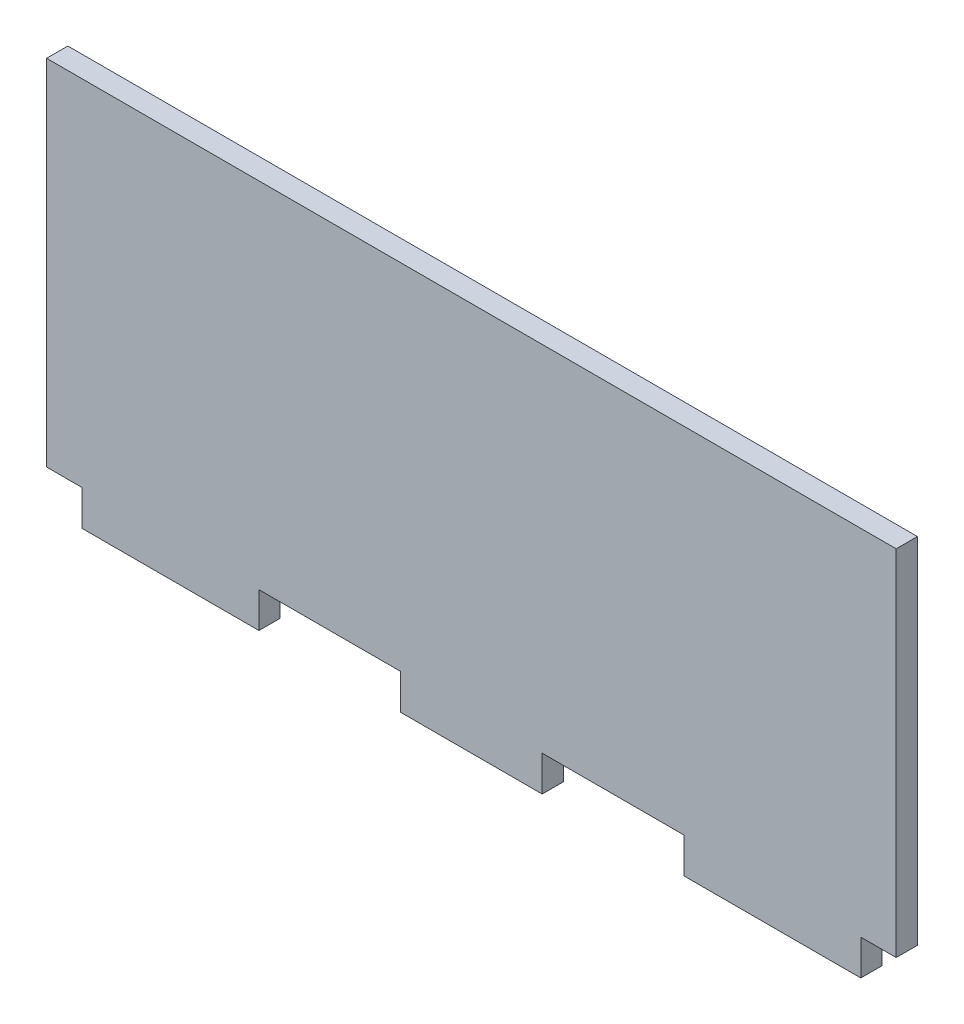
ISO-10303-21;
HEADER;
FILE_DESCRIPTION(('STEP AP214'),'2;1');
FILE_NAME('part.step','',(''),(''),'','','');
FILE_SCHEMA(('AUTOMOTIVE_DESIGN { 1 0 10303 214 1 1 1 1 }'));
ENDSEC;
DATA;
#1=APPLICATION_CONTEXT('core data for automotive mechanical design processes');
#2=APPLICATION_PROTOCOL_DEFINITION('international standard','automotive_design',2000,#1);
#3=PRODUCT_CONTEXT('',#1,'mechanical');
#4=PRODUCT('Part','Part','',(#3));
#5=PRODUCT_RELATED_PRODUCT_CATEGORY('part','',(#4));
#6=PRODUCT_DEFINITION_FORMATION('','',#4);
#7=PRODUCT_DEFINITION_CONTEXT('part definition',#1,'design');
#8=PRODUCT_DEFINITION('design','',#6,#7);
#9=PRODUCT_DEFINITION_SHAPE('','',#8);
#10=(LENGTH_UNIT() NAMED_UNIT(*) SI_UNIT(.MILLI.,.METRE.));
#11=(NAMED_UNIT(*) PLANE_ANGLE_UNIT() SI_UNIT($,.RADIAN.));
#12=(NAMED_UNIT(*) SI_UNIT($,.STERADIAN.) SOLID_ANGLE_UNIT());
#13=UNCERTAINTY_MEASURE_WITH_UNIT(LENGTH_MEASURE(1.E-05),#10,'distance_accuracy_value','');
#14=(GEOMETRIC_REPRESENTATION_CONTEXT(3) GLOBAL_UNCERTAINTY_ASSIGNED_CONTEXT((#13)) GLOBAL_UNIT_ASSIGNED_CONTEXT((#10,
#11,#12)) REPRESENTATION_CONTEXT('',''));
#15=CARTESIAN_POINT('',(0.,0.,0.));
#16=DIRECTION('',(0.,0.,1.));
#17=DIRECTION('',(1.,0.,0.));
#18=AXIS2_PLACEMENT_3D('',#15,#16,#17);
#19=CARTESIAN_POINT('',(-73.4907773117798,27.1036585365854,3.));
#20=DIRECTION('',(1.,0.,0.));
#21=DIRECTION('',(0.,1.,0.));
#22=AXIS2_PLACEMENT_3D('',#19,#20,#21);
#23=PLANE('',#22);
#24=DIRECTION('',(0.,-1.,0.));
#25=VECTOR('',#24,1.);
#26=CARTESIAN_POINT('',(-73.4907773117798,27.1036585365854,0.));
#27=LINE('',#26,#25);
#28=CARTESIAN_POINT('',(-73.4907773117798,27.1036585365854,0.));
#29=VERTEX_POINT('',#28);
#30=CARTESIAN_POINT('',(-73.4907773117798,-22.8963414634146,0.));
#31=VERTEX_POINT('',#30);
#32=EDGE_CURVE('E177',#29,#31,#27,.T.);
#33=ORIENTED_EDGE('',*,*,#32,.T.);
#34=DIRECTION('',(0.,0.,-1.));
#35=VECTOR('',#34,1.);
#36=CARTESIAN_POINT('',(-73.4907773117798,-22.8963414634146,3.));
#37=LINE('',#36,#35);
#38=CARTESIAN_POINT('',(-73.4907773117798,-22.8963414634146,3.));
#39=VERTEX_POINT('',#38);
#40=EDGE_CURVE('E11',#39,#31,#37,.T.);
#41=ORIENTED_EDGE('',*,*,#40,.F.);
#42=DIRECTION('',(0.,-1.,0.));
#43=VECTOR('',#42,1.);
#44=CARTESIAN_POINT('',(-73.4907773117798,27.1036585365854,3.));
#45=LINE('',#44,#43);
#46=CARTESIAN_POINT('',(-73.4907773117798,27.1036585365854,3.));
#47=VERTEX_POINT('',#46);
#48=EDGE_CURVE('E207',#47,#39,#45,.T.);
#49=ORIENTED_EDGE('',*,*,#48,.F.);
#50=DIRECTION('',(0.,0.,-1.));
#51=VECTOR('',#50,1.);
#52=CARTESIAN_POINT('',(-73.4907773117798,27.1036585365854,3.));
#53=LINE('',#52,#51);
#54=EDGE_CURVE('E173',#47,#29,#53,.T.);
#55=ORIENTED_EDGE('',*,*,#54,.T.);
#56=EDGE_LOOP('',(#33,#41,#49,#55));
#57=FACE_BOUND('',#56,.T.);
#58=ADVANCED_FACE('F33',(#57),#23,.F.);
#59=CARTESIAN_POINT('',(-73.4907773117798,-22.8963414634146,3.));
#60=DIRECTION('',(0.,1.,0.));
#61=DIRECTION('',(0.,0.,1.));
#62=AXIS2_PLACEMENT_3D('',#59,#60,#61);
#63=PLANE('',#62);
#64=DIRECTION('',(1.,0.,0.));
#65=VECTOR('',#64,1.);
#66=CARTESIAN_POINT('',(-73.4907773117798,-22.8963414634146,0.));
#67=LINE('',#66,#65);
#68=CARTESIAN_POINT('',(-68.4907773117798,-22.8963414634146,0.));
#69=VERTEX_POINT('',#68);
#70=EDGE_CURVE('E180',#31,#69,#67,.T.);
#71=ORIENTED_EDGE('',*,*,#70,.T.);
#72=DIRECTION('',(0.,0.,-1.));
#73=VECTOR('',#72,1.);
#74=CARTESIAN_POINT('',(-68.4907773117798,-22.8963414634146,3.));
#75=LINE('',#74,#73);
#76=CARTESIAN_POINT('',(-68.4907773117798,-22.8963414634146,3.));
#77=VERTEX_POINT('',#76);
#78=EDGE_CURVE('E41',#77,#69,#75,.T.);
#79=ORIENTED_EDGE('',*,*,#78,.F.);
#80=DIRECTION('',(1.,0.,0.));
#81=VECTOR('',#80,1.);
#82=CARTESIAN_POINT('',(-73.4907773117798,-22.8963414634146,3.));
#83=LINE('',#82,#81);
#84=EDGE_CURVE('E116',#39,#77,#83,.T.);
#85=ORIENTED_EDGE('',*,*,#84,.F.);
#86=ORIENTED_EDGE('',*,*,#40,.T.);
#87=EDGE_LOOP('',(#71,#79,#85,#86));
#88=FACE_BOUND('',#87,.T.);
#89=ADVANCED_FACE('F305',(#88),#63,.F.);
#90=CARTESIAN_POINT('',(-68.4907773117798,-22.8963414634146,3.));
#91=DIRECTION('',(1.,0.,0.));
#92=DIRECTION('',(0.,0.,-1.));
#93=AXIS2_PLACEMENT_3D('',#90,#91,#92);
#94=PLANE('',#93);
#95=DIRECTION('',(0.,-1.,0.));
#96=VECTOR('',#95,1.);
#97=CARTESIAN_POINT('',(-68.4907773117798,-22.8963414634146,0.));
#98=LINE('',#97,#96);
#99=CARTESIAN_POINT('',(-68.4907773117798,-27.8963414634146,0.));
#100=VERTEX_POINT('',#99);
#101=EDGE_CURVE('E182',#69,#100,#98,.T.);
#102=ORIENTED_EDGE('',*,*,#101,.T.);
#103=DIRECTION('',(0.,0.,-1.));
#104=VECTOR('',#103,1.);
#105=CARTESIAN_POINT('',(-68.4907773117798,-27.8963414634146,3.));
#106=LINE('',#105,#104);
#107=CARTESIAN_POINT('',(-68.4907773117798,-27.8963414634146,3.));
#108=VERTEX_POINT('',#107);
#109=EDGE_CURVE('E238',#108,#100,#106,.T.);
#110=ORIENTED_EDGE('',*,*,#109,.F.);
#111=DIRECTION('',(0.,-1.,0.));
#112=VECTOR('',#111,1.);
#113=CARTESIAN_POINT('',(-68.4907773117798,-22.8963414634146,3.));
#114=LINE('',#113,#112);
#115=EDGE_CURVE('E246',#77,#108,#114,.T.);
#116=ORIENTED_EDGE('',*,*,#115,.F.);
#117=ORIENTED_EDGE('',*,*,#78,.T.);
#118=EDGE_LOOP('',(#102,#110,#116,#117));
#119=FACE_BOUND('',#118,.T.);
#120=ADVANCED_FACE('F244',(#119),#94,.F.);
#121=CARTESIAN_POINT('',(-68.4907773117798,-27.8963414634146,3.));
#122=DIRECTION('',(0.,1.,0.));
#123=DIRECTION('',(0.,0.,1.));
#124=AXIS2_PLACEMENT_3D('',#121,#122,#123);
#125=PLANE('',#124);
#126=DIRECTION('',(1.,0.,0.));
#127=VECTOR('',#126,1.);
#128=CARTESIAN_POINT('',(-68.4907773117798,-27.8963414634146,0.));
#129=LINE('',#128,#127);
#130=CARTESIAN_POINT('',(-43.4907773117798,-27.8963414634146,0.));
#131=VERTEX_POINT('',#130);
#132=EDGE_CURVE('E184',#100,#131,#129,.T.);
#133=ORIENTED_EDGE('',*,*,#132,.T.);
#134=DIRECTION('',(0.,0.,-1.));
#135=VECTOR('',#134,1.);
#136=CARTESIAN_POINT('',(-43.4907773117798,-27.8963414634146,3.));
#137=LINE('',#136,#135);
#138=CARTESIAN_POINT('',(-43.4907773117798,-27.8963414634146,3.));
#139=VERTEX_POINT('',#138);
#140=EDGE_CURVE('E235',#139,#131,#137,.T.);
#141=ORIENTED_EDGE('',*,*,#140,.F.);
#142=DIRECTION('',(1.,0.,0.));
#143=VECTOR('',#142,1.);
#144=CARTESIAN_POINT('',(-68.4907773117798,-27.8963414634146,3.));
#145=LINE('',#144,#143);
#146=EDGE_CURVE('E264',#108,#139,#145,.T.);
#147=ORIENTED_EDGE('',*,*,#146,.F.);
#148=ORIENTED_EDGE('',*,*,#109,.T.);
#149=EDGE_LOOP('',(#133,#141,#147,#148));
#150=FACE_BOUND('',#149,.T.);
#151=ADVANCED_FACE('F255',(#150),#125,.F.);
#152=CARTESIAN_POINT('',(-43.4907773117798,-22.8963414634146,3.));
#153=DIRECTION('',(-1.,0.,0.));
#154=DIRECTION('',(0.,0.,1.));
#155=AXIS2_PLACEMENT_3D('',#152,#153,#154);
#156=PLANE('',#155);
#157=DIRECTION('',(0.,1.,0.));
#158=VECTOR('',#157,1.);
#159=CARTESIAN_POINT('',(-43.4907773117798,-22.8963414634146,0.));
#160=LINE('',#159,#158);
#161=CARTESIAN_POINT('',(-43.4907773117798,-22.8963414634146,0.));
#162=VERTEX_POINT('',#161);
#163=EDGE_CURVE('E186',#131,#162,#160,.T.);
#164=ORIENTED_EDGE('',*,*,#163,.T.);
#165=DIRECTION('',(0.,0.,-1.));
#166=VECTOR('',#165,1.);
#167=CARTESIAN_POINT('',(-43.4907773117798,-22.8963414634146,3.));
#168=LINE('',#167,#166);
#169=CARTESIAN_POINT('',(-43.4907773117798,-22.8963414634146,3.));
#170=VERTEX_POINT('',#169);
#171=EDGE_CURVE('E232',#170,#162,#168,.T.);
#172=ORIENTED_EDGE('',*,*,#171,.F.);
#173=DIRECTION('',(0.,1.,0.));
#174=VECTOR('',#173,1.);
#175=CARTESIAN_POINT('',(-43.4907773117798,-22.8963414634146,3.));
#176=LINE('',#175,#174);
#177=EDGE_CURVE('E261',#139,#170,#176,.T.);
#178=ORIENTED_EDGE('',*,*,#177,.F.);
#179=ORIENTED_EDGE('',*,*,#140,.T.);
#180=EDGE_LOOP('',(#164,#172,#178,#179));
#181=FACE_BOUND('',#180,.T.);
#182=ADVANCED_FACE('F259',(#181),#156,.F.);
#183=CARTESIAN_POINT('',(-43.4907773117798,-22.8963414634146,3.));
#184=DIRECTION('',(0.,1.,0.));
#185=DIRECTION('',(-1.,0.,0.));
#186=AXIS2_PLACEMENT_3D('',#183,#184,#185);
#187=PLANE('',#186);
#188=DIRECTION('',(1.,0.,0.));
#189=VECTOR('',#188,1.);
#190=CARTESIAN_POINT('',(-43.4907773117798,-22.8963414634146,0.));
#191=LINE('',#190,#189);
#192=CARTESIAN_POINT('',(-23.4907773117798,-22.8963414634146,0.));
#193=VERTEX_POINT('',#192);
#194=EDGE_CURVE('E188',#162,#193,#191,.T.);
#195=ORIENTED_EDGE('',*,*,#194,.T.);
#196=DIRECTION('',(0.,0.,-1.));
#197=VECTOR('',#196,1.);
#198=CARTESIAN_POINT('',(-23.4907773117798,-22.8963414634146,3.));
#199=LINE('',#198,#197);
#200=CARTESIAN_POINT('',(-23.4907773117798,-22.8963414634146,3.));
#201=VERTEX_POINT('',#200);
#202=EDGE_CURVE('E229',#201,#193,#199,.T.);
#203=ORIENTED_EDGE('',*,*,#202,.F.);
#204=DIRECTION('',(1.,0.,0.));
#205=VECTOR('',#204,1.);
#206=CARTESIAN_POINT('',(-43.4907773117798,-22.8963414634146,3.));
#207=LINE('',#206,#205);
#208=EDGE_CURVE('E263',#170,#201,#207,.T.);
#209=ORIENTED_EDGE('',*,*,#208,.F.);
#210=ORIENTED_EDGE('',*,*,#171,.T.);
#211=EDGE_LOOP('',(#195,#203,#209,#210));
#212=FACE_BOUND('',#211,.T.);
#213=ADVANCED_FACE('F318',(#212),#187,.F.);
#214=CARTESIAN_POINT('',(-23.4907773117798,-22.8963414634146,3.));
#215=DIRECTION('',(1.,0.,0.));
#216=DIRECTION('',(0.,1.,0.));
#217=AXIS2_PLACEMENT_3D('',#214,#215,#216);
#218=PLANE('',#217);
#219=DIRECTION('',(0.,-1.,0.));
#220=VECTOR('',#219,1.);
#221=CARTESIAN_POINT('',(-23.4907773117798,-22.8963414634146,0.));
#222=LINE('',#221,#220);
#223=CARTESIAN_POINT('',(-23.4907773117798,-27.8963414634147,0.));
#224=VERTEX_POINT('',#223);
#225=EDGE_CURVE('E190',#193,#224,#222,.T.);
#226=ORIENTED_EDGE('',*,*,#225,.T.);
#227=DIRECTION('',(0.,0.,-1.));
#228=VECTOR('',#227,1.);
#229=CARTESIAN_POINT('',(-23.4907773117798,-27.8963414634147,3.));
#230=LINE('',#229,#228);
#231=CARTESIAN_POINT('',(-23.4907773117798,-27.8963414634147,3.));
#232=VERTEX_POINT('',#231);
#233=EDGE_CURVE('E226',#232,#224,#230,.T.);
#234=ORIENTED_EDGE('',*,*,#233,.F.);
#235=DIRECTION('',(0.,-1.,0.));
#236=VECTOR('',#235,1.);
#237=CARTESIAN_POINT('',(-23.4907773117798,-22.8963414634146,3.));
#238=LINE('',#237,#236);
#239=EDGE_CURVE('E266',#201,#232,#238,.T.);
#240=ORIENTED_EDGE('',*,*,#239,.F.);
#241=ORIENTED_EDGE('',*,*,#202,.T.);
#242=EDGE_LOOP('',(#226,#234,#240,#241));
#243=FACE_BOUND('',#242,.T.);
#244=ADVANCED_FACE('F321',(#243),#218,.F.);
#245=CARTESIAN_POINT('',(-23.4907773117798,-27.8963414634147,3.));
#246=DIRECTION('',(0.,1.,0.));
#247=DIRECTION('',(-1.,0.,0.));
#248=AXIS2_PLACEMENT_3D('',#245,#246,#247);
#249=PLANE('',#248);
#250=DIRECTION('',(1.,0.,0.));
#251=VECTOR('',#250,1.);
#252=CARTESIAN_POINT('',(-23.4907773117798,-27.8963414634147,0.));
#253=LINE('',#252,#251);
#254=CARTESIAN_POINT('',(-3.49077731177982,-27.8963414634146,0.));
#255=VERTEX_POINT('',#254);
#256=EDGE_CURVE('E192',#224,#255,#253,.T.);
#257=ORIENTED_EDGE('',*,*,#256,.T.);
#258=DIRECTION('',(0.,0.,-1.));
#259=VECTOR('',#258,1.);
#260=CARTESIAN_POINT('',(-3.49077731177982,-27.8963414634146,3.));
#261=LINE('',#260,#259);
#262=CARTESIAN_POINT('',(-3.49077731177982,-27.8963414634146,3.));
#263=VERTEX_POINT('',#262);
#264=EDGE_CURVE('E223',#263,#255,#261,.T.);
#265=ORIENTED_EDGE('',*,*,#264,.F.);
#266=DIRECTION('',(1.,0.,0.));
#267=VECTOR('',#266,1.);
#268=CARTESIAN_POINT('',(-23.4907773117798,-27.8963414634147,3.));
#269=LINE('',#268,#267);
#270=EDGE_CURVE('E272',#232,#263,#269,.T.);
#271=ORIENTED_EDGE('',*,*,#270,.F.);
#272=ORIENTED_EDGE('',*,*,#233,.T.);
#273=EDGE_LOOP('',(#257,#265,#271,#272));
#274=FACE_BOUND('',#273,.T.);
#275=ADVANCED_FACE('F325',(#274),#249,.F.);
#276=CARTESIAN_POINT('',(-3.49077731177982,-22.8963414634146,3.));
#277=DIRECTION('',(-1.,0.,0.));
#278=DIRECTION('',(0.,0.,1.));
#279=AXIS2_PLACEMENT_3D('',#276,#277,#278);
#280=PLANE('',#279);
#281=DIRECTION('',(0.,1.,0.));
#282=VECTOR('',#281,1.);
#283=CARTESIAN_POINT('',(-3.49077731177982,-22.8963414634146,0.));
#284=LINE('',#283,#282);
#285=CARTESIAN_POINT('',(-3.49077731177982,-22.8963414634146,0.));
#286=VERTEX_POINT('',#285);
#287=EDGE_CURVE('E194',#255,#286,#284,.T.);
#288=ORIENTED_EDGE('',*,*,#287,.T.);
#289=DIRECTION('',(0.,0.,-1.));
#290=VECTOR('',#289,1.);
#291=CARTESIAN_POINT('',(-3.49077731177982,-22.8963414634146,3.));
#292=LINE('',#291,#290);
#293=CARTESIAN_POINT('',(-3.49077731177982,-22.8963414634146,3.));
#294=VERTEX_POINT('',#293);
#295=EDGE_CURVE('E220',#294,#286,#292,.T.);
#296=ORIENTED_EDGE('',*,*,#295,.F.);
#297=DIRECTION('',(0.,1.,0.));
#298=VECTOR('',#297,1.);
#299=CARTESIAN_POINT('',(-3.49077731177982,-22.8963414634146,3.));
#300=LINE('',#299,#298);
#301=EDGE_CURVE('E274',#263,#294,#300,.T.);
#302=ORIENTED_EDGE('',*,*,#301,.F.);
#303=ORIENTED_EDGE('',*,*,#264,.T.);
#304=EDGE_LOOP('',(#288,#296,#302,#303));
#305=FACE_BOUND('',#304,.T.);
#306=ADVANCED_FACE('F329',(#305),#280,.F.);
#307=CARTESIAN_POINT('',(-3.49077731177982,-22.8963414634146,3.));
#308=DIRECTION('',(0.,1.,0.));
#309=DIRECTION('',(-1.,0.,0.));
#310=AXIS2_PLACEMENT_3D('',#307,#308,#309);
#311=PLANE('',#310);
#312=DIRECTION('',(1.,0.,0.));
#313=VECTOR('',#312,1.);
#314=CARTESIAN_POINT('',(-3.49077731177982,-22.8963414634146,0.));
#315=LINE('',#314,#313);
#316=CARTESIAN_POINT('',(16.5092226882202,-22.8963414634146,0.));
#317=VERTEX_POINT('',#316);
#318=EDGE_CURVE('E196',#286,#317,#315,.T.);
#319=ORIENTED_EDGE('',*,*,#318,.T.);
#320=DIRECTION('',(0.,0.,-1.));
#321=VECTOR('',#320,1.);
#322=CARTESIAN_POINT('',(16.5092226882202,-22.8963414634146,3.));
#323=LINE('',#322,#321);
#324=CARTESIAN_POINT('',(16.5092226882202,-22.8963414634146,3.));
#325=VERTEX_POINT('',#324);
#326=EDGE_CURVE('E217',#325,#317,#323,.T.);
#327=ORIENTED_EDGE('',*,*,#326,.F.);
#328=DIRECTION('',(1.,0.,0.));
#329=VECTOR('',#328,1.);
#330=CARTESIAN_POINT('',(-3.49077731177982,-22.8963414634146,3.));
#331=LINE('',#330,#329);
#332=EDGE_CURVE('E276',#294,#325,#331,.T.);
#333=ORIENTED_EDGE('',*,*,#332,.F.);
#334=ORIENTED_EDGE('',*,*,#295,.T.);
#335=EDGE_LOOP('',(#319,#327,#333,#334));
#336=FACE_BOUND('',#335,.T.);
#337=ADVANCED_FACE('F333',(#336),#311,.F.);
#338=CARTESIAN_POINT('',(16.5092226882202,-22.8963414634146,3.));
#339=DIRECTION('',(1.,0.,0.));
#340=DIRECTION('',(0.,0.,-1.));
#341=AXIS2_PLACEMENT_3D('',#338,#339,#340);
#342=PLANE('',#341);
#343=DIRECTION('',(0.,-1.,0.));
#344=VECTOR('',#343,1.);
#345=CARTESIAN_POINT('',(16.5092226882202,-22.8963414634146,0.));
#346=LINE('',#345,#344);
#347=CARTESIAN_POINT('',(16.5092226882202,-27.8963414634147,0.));
#348=VERTEX_POINT('',#347);
#349=EDGE_CURVE('E198',#317,#348,#346,.T.);
#350=ORIENTED_EDGE('',*,*,#349,.T.);
#351=DIRECTION('',(0.,0.,-1.));
#352=VECTOR('',#351,1.);
#353=CARTESIAN_POINT('',(16.5092226882202,-27.8963414634147,3.));
#354=LINE('',#353,#352);
#355=CARTESIAN_POINT('',(16.5092226882202,-27.8963414634147,3.));
#356=VERTEX_POINT('',#355);
#357=EDGE_CURVE('E214',#356,#348,#354,.T.);
#358=ORIENTED_EDGE('',*,*,#357,.F.);
#359=DIRECTION('',(0.,-1.,0.));
#360=VECTOR('',#359,1.);
#361=CARTESIAN_POINT('',(16.5092226882202,-22.8963414634146,3.));
#362=LINE('',#361,#360);
#363=EDGE_CURVE('E278',#325,#356,#362,.T.);
#364=ORIENTED_EDGE('',*,*,#363,.F.);
#365=ORIENTED_EDGE('',*,*,#326,.T.);
#366=EDGE_LOOP('',(#350,#358,#364,#365));
#367=FACE_BOUND('',#366,.T.);
#368=ADVANCED_FACE('F337',(#367),#342,.F.);
#369=CARTESIAN_POINT('',(16.5092226882202,-27.8963414634147,3.));
#370=DIRECTION('',(0.,1.,0.));
#371=DIRECTION('',(-1.,0.,0.));
#372=AXIS2_PLACEMENT_3D('',#369,#370,#371);
#373=PLANE('',#372);
#374=DIRECTION('',(1.,0.,0.));
#375=VECTOR('',#374,1.);
#376=CARTESIAN_POINT('',(16.5092226882202,-27.8963414634147,0.));
#377=LINE('',#376,#375);
#378=CARTESIAN_POINT('',(41.5092226882202,-27.8963414634146,0.));
#379=VERTEX_POINT('',#378);
#380=EDGE_CURVE('E200',#348,#379,#377,.T.);
#381=ORIENTED_EDGE('',*,*,#380,.T.);
#382=DIRECTION('',(0.,0.,-1.));
#383=VECTOR('',#382,1.);
#384=CARTESIAN_POINT('',(41.5092226882202,-27.8963414634146,3.));
#385=LINE('',#384,#383);
#386=CARTESIAN_POINT('',(41.5092226882202,-27.8963414634146,3.));
#387=VERTEX_POINT('',#386);
#388=EDGE_CURVE('E211',#387,#379,#385,.T.);
#389=ORIENTED_EDGE('',*,*,#388,.F.);
#390=DIRECTION('',(1.,0.,0.));
#391=VECTOR('',#390,1.);
#392=CARTESIAN_POINT('',(16.5092226882202,-27.8963414634147,3.));
#393=LINE('',#392,#391);
#394=EDGE_CURVE('E280',#356,#387,#393,.T.);
#395=ORIENTED_EDGE('',*,*,#394,.F.);
#396=ORIENTED_EDGE('',*,*,#357,.T.);
#397=EDGE_LOOP('',(#381,#389,#395,#396));
#398=FACE_BOUND('',#397,.T.);
#399=ADVANCED_FACE('F286',(#398),#373,.F.);
#400=CARTESIAN_POINT('',(41.5092226882202,-22.8963414634146,3.));
#401=DIRECTION('',(-1.,0.,0.));
#402=DIRECTION('',(0.,0.,1.));
#403=AXIS2_PLACEMENT_3D('',#400,#401,#402);
#404=PLANE('',#403);
#405=DIRECTION('',(0.,1.,0.));
#406=VECTOR('',#405,1.);
#407=CARTESIAN_POINT('',(41.5092226882202,-22.8963414634146,0.));
#408=LINE('',#407,#406);
#409=CARTESIAN_POINT('',(41.5092226882202,-22.8963414634146,0.));
#410=VERTEX_POINT('',#409);
#411=EDGE_CURVE('E202',#379,#410,#408,.T.);
#412=ORIENTED_EDGE('',*,*,#411,.T.);
#413=DIRECTION('',(0.,0.,-1.));
#414=VECTOR('',#413,1.);
#415=CARTESIAN_POINT('',(41.5092226882202,-22.8963414634146,3.));
#416=LINE('',#415,#414);
#417=CARTESIAN_POINT('',(41.5092226882202,-22.8963414634146,3.));
#418=VERTEX_POINT('',#417);
#419=EDGE_CURVE('E168',#418,#410,#416,.T.);
#420=ORIENTED_EDGE('',*,*,#419,.F.);
#421=DIRECTION('',(0.,1.,0.));
#422=VECTOR('',#421,1.);
#423=CARTESIAN_POINT('',(41.5092226882202,-22.8963414634146,3.));
#424=LINE('',#423,#422);
#425=EDGE_CURVE('E159',#387,#418,#424,.T.);
#426=ORIENTED_EDGE('',*,*,#425,.F.);
#427=ORIENTED_EDGE('',*,*,#388,.T.);
#428=EDGE_LOOP('',(#412,#420,#426,#427));
#429=FACE_BOUND('',#428,.T.);
#430=ADVANCED_FACE('F290',(#429),#404,.F.);
#431=CARTESIAN_POINT('',(41.5092226882202,-22.8963414634146,3.));
#432=DIRECTION('',(0.,1.,0.));
#433=DIRECTION('',(0.,0.,1.));
#434=AXIS2_PLACEMENT_3D('',#431,#432,#433);
#435=PLANE('',#434);
#436=DIRECTION('',(1.,0.,0.));
#437=VECTOR('',#436,1.);
#438=CARTESIAN_POINT('',(41.5092226882202,-22.8963414634146,0.));
#439=LINE('',#438,#437);
#440=CARTESIAN_POINT('',(46.5092226882202,-22.8963414634146,0.));
#441=VERTEX_POINT('',#440);
#442=EDGE_CURVE('E167',#410,#441,#439,.T.);
#443=ORIENTED_EDGE('',*,*,#442,.T.);
#444=DIRECTION('',(0.,0.,-1.));
#445=VECTOR('',#444,1.);
#446=CARTESIAN_POINT('',(46.5092226882202,-22.8963414634146,3.));
#447=LINE('',#446,#445);
#448=CARTESIAN_POINT('',(46.5092226882202,-22.8963414634146,3.));
#449=VERTEX_POINT('',#448);
#450=EDGE_CURVE('E164',#449,#441,#447,.T.);
#451=ORIENTED_EDGE('',*,*,#450,.F.);
#452=DIRECTION('',(1.,0.,0.));
#453=VECTOR('',#452,1.);
#454=CARTESIAN_POINT('',(41.5092226882202,-22.8963414634146,3.));
#455=LINE('',#454,#453);
#456=EDGE_CURVE('E153',#418,#449,#455,.T.);
#457=ORIENTED_EDGE('',*,*,#456,.F.);
#458=ORIENTED_EDGE('',*,*,#419,.T.);
#459=EDGE_LOOP('',(#443,#451,#457,#458));
#460=FACE_BOUND('',#459,.T.);
#461=ADVANCED_FACE('F165',(#460),#435,.F.);
#462=CARTESIAN_POINT('',(46.5092226882202,27.1036585365854,3.));
#463=DIRECTION('',(-1.,0.,0.));
#464=DIRECTION('',(0.,-1.,0.));
#465=AXIS2_PLACEMENT_3D('',#462,#463,#464);
#466=PLANE('',#465);
#467=DIRECTION('',(0.,1.,0.));
#468=VECTOR('',#467,1.);
#469=CARTESIAN_POINT('',(46.5092226882202,27.1036585365854,0.));
#470=LINE('',#469,#468);
#471=CARTESIAN_POINT('',(46.5092226882202,27.1036585365854,0.));
#472=VERTEX_POINT('',#471);
#473=EDGE_CURVE('E102',#441,#472,#470,.T.);
#474=ORIENTED_EDGE('',*,*,#473,.T.);
#475=DIRECTION('',(0.,0.,-1.));
#476=VECTOR('',#475,1.);
#477=CARTESIAN_POINT('',(46.5092226882202,27.1036585365854,3.));
#478=LINE('',#477,#476);
#479=CARTESIAN_POINT('',(46.5092226882202,27.1036585365854,3.));
#480=VERTEX_POINT('',#479);
#481=EDGE_CURVE('E169',#480,#472,#478,.T.);
#482=ORIENTED_EDGE('',*,*,#481,.F.);
#483=DIRECTION('',(0.,1.,0.));
#484=VECTOR('',#483,1.);
#485=CARTESIAN_POINT('',(46.5092226882202,27.1036585365854,3.));
#486=LINE('',#485,#484);
#487=EDGE_CURVE('E157',#449,#480,#486,.T.);
#488=ORIENTED_EDGE('',*,*,#487,.F.);
#489=ORIENTED_EDGE('',*,*,#450,.T.);
#490=EDGE_LOOP('',(#474,#482,#488,#489));
#491=FACE_BOUND('',#490,.T.);
#492=ADVANCED_FACE('F171',(#491),#466,.F.);
#493=CARTESIAN_POINT('',(-73.4907773117798,27.1036585365854,3.));
#494=DIRECTION('',(0.,-1.,0.));
#495=DIRECTION('',(1.,0.,0.));
#496=AXIS2_PLACEMENT_3D('',#493,#494,#495);
#497=PLANE('',#496);
#498=DIRECTION('',(-1.,0.,0.));
#499=VECTOR('',#498,1.);
#500=CARTESIAN_POINT('',(-73.4907773117798,27.1036585365854,0.));
#501=LINE('',#500,#499);
#502=EDGE_CURVE('E108',#472,#29,#501,.T.);
#503=ORIENTED_EDGE('',*,*,#502,.T.);
#504=ORIENTED_EDGE('',*,*,#54,.F.);
#505=DIRECTION('',(-1.,0.,0.));
#506=VECTOR('',#505,1.);
#507=CARTESIAN_POINT('',(-73.4907773117798,27.1036585365854,3.));
#508=LINE('',#507,#506);
#509=EDGE_CURVE('E49',#480,#47,#508,.T.);
#510=ORIENTED_EDGE('',*,*,#509,.F.);
#511=ORIENTED_EDGE('',*,*,#481,.T.);
#512=EDGE_LOOP('',(#503,#504,#510,#511));
#513=FACE_BOUND('',#512,.T.);
#514=ADVANCED_FACE('F294',(#513),#497,.F.);
#515=CARTESIAN_POINT('',(0.,0.,3.));
#516=DIRECTION('',(0.,0.,1.));
#517=DIRECTION('',(1.,0.,0.));
#518=AXIS2_PLACEMENT_3D('',#515,#516,#517);
#519=PLANE('',#518);
#520=ORIENTED_EDGE('',*,*,#48,.T.);
#521=ORIENTED_EDGE('',*,*,#84,.T.);
#522=ORIENTED_EDGE('',*,*,#115,.T.);
#523=ORIENTED_EDGE('',*,*,#146,.T.);
#524=ORIENTED_EDGE('',*,*,#177,.T.);
#525=ORIENTED_EDGE('',*,*,#208,.T.);
#526=ORIENTED_EDGE('',*,*,#239,.T.);
#527=ORIENTED_EDGE('',*,*,#270,.T.);
#528=ORIENTED_EDGE('',*,*,#301,.T.);
#529=ORIENTED_EDGE('',*,*,#332,.T.);
#530=ORIENTED_EDGE('',*,*,#363,.T.);
#531=ORIENTED_EDGE('',*,*,#394,.T.);
#532=ORIENTED_EDGE('',*,*,#425,.T.);
#533=ORIENTED_EDGE('',*,*,#456,.T.);
#534=ORIENTED_EDGE('',*,*,#487,.T.);
#535=ORIENTED_EDGE('',*,*,#509,.T.);
#536=EDGE_LOOP('',(#520,#521,#522,#523,#524,#525,#526,#527,#528,#529,#530,#531,#532,#533,#534,#535));
#537=FACE_BOUND('',#536,.T.);
#538=ADVANCED_FACE('F155',(#537),#519,.T.);
#539=CARTESIAN_POINT('',(0.,0.,0.));
#540=DIRECTION('',(0.,0.,1.));
#541=DIRECTION('',(1.,0.,0.));
#542=AXIS2_PLACEMENT_3D('',#539,#540,#541);
#543=PLANE('',#542);
#544=ORIENTED_EDGE('',*,*,#32,.F.);
#545=ORIENTED_EDGE('',*,*,#502,.F.);
#546=ORIENTED_EDGE('',*,*,#473,.F.);
#547=ORIENTED_EDGE('',*,*,#442,.F.);
#548=ORIENTED_EDGE('',*,*,#411,.F.);
#549=ORIENTED_EDGE('',*,*,#380,.F.);
#550=ORIENTED_EDGE('',*,*,#349,.F.);
#551=ORIENTED_EDGE('',*,*,#318,.F.);
#552=ORIENTED_EDGE('',*,*,#287,.F.);
#553=ORIENTED_EDGE('',*,*,#256,.F.);
#554=ORIENTED_EDGE('',*,*,#225,.F.);
#555=ORIENTED_EDGE('',*,*,#194,.F.);
#556=ORIENTED_EDGE('',*,*,#163,.F.);
#557=ORIENTED_EDGE('',*,*,#132,.F.);
#558=ORIENTED_EDGE('',*,*,#101,.F.);
#559=ORIENTED_EDGE('',*,*,#70,.F.);
#560=EDGE_LOOP('',(#544,#545,#546,#547,#548,#549,#550,#551,#552,#553,#554,#555,#556,#557,#558,#559));
#561=FACE_BOUND('',#560,.T.);
#562=ADVANCED_FACE('F250',(#561),#543,.F.);
#563=CLOSED_SHELL('',(#58,#89,#120,#151,#182,#213,#244,#275,#306,#337,#368,#399,#430,#461,#492,
#514,#538,#562));
#564=MANIFOLD_SOLID_BREP('B2',#563);
#565=ADVANCED_BREP_SHAPE_REPRESENTATION('',(#18,#564),#14);
#566=SHAPE_DEFINITION_REPRESENTATION(#9,#565);
ENDSEC;
END-ISO-10303-21;
